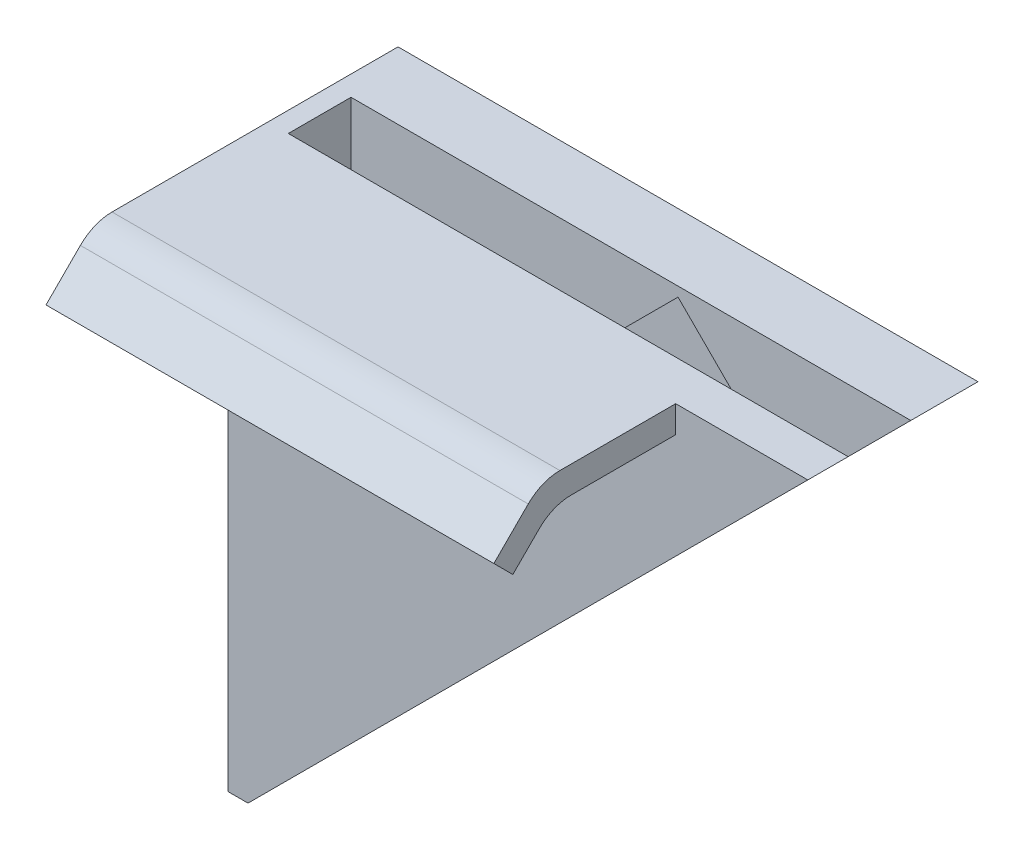
ISO-10303-21;
HEADER;
FILE_DESCRIPTION(('STEP AP214'),'2;1');
FILE_NAME('part.step','',(''),(''),'','','');
FILE_SCHEMA(('AUTOMOTIVE_DESIGN { 1 0 10303 214 1 1 1 1 }'));
ENDSEC;
DATA;
#1=APPLICATION_CONTEXT('core data for automotive mechanical design processes');
#2=APPLICATION_PROTOCOL_DEFINITION('international standard','automotive_design',2000,#1);
#3=PRODUCT_CONTEXT('',#1,'mechanical');
#4=PRODUCT('Part','Part','',(#3));
#5=PRODUCT_RELATED_PRODUCT_CATEGORY('part','',(#4));
#6=PRODUCT_DEFINITION_FORMATION('','',#4);
#7=PRODUCT_DEFINITION_CONTEXT('part definition',#1,'design');
#8=PRODUCT_DEFINITION('design','',#6,#7);
#9=PRODUCT_DEFINITION_SHAPE('','',#8);
#10=(LENGTH_UNIT() NAMED_UNIT(*) SI_UNIT(.MILLI.,.METRE.));
#11=(NAMED_UNIT(*) PLANE_ANGLE_UNIT() SI_UNIT($,.RADIAN.));
#12=(NAMED_UNIT(*) SI_UNIT($,.STERADIAN.) SOLID_ANGLE_UNIT());
#13=UNCERTAINTY_MEASURE_WITH_UNIT(LENGTH_MEASURE(1.E-05),#10,'distance_accuracy_value','');
#14=(GEOMETRIC_REPRESENTATION_CONTEXT(3) GLOBAL_UNCERTAINTY_ASSIGNED_CONTEXT((#13)) GLOBAL_UNIT_ASSIGNED_CONTEXT((#10,
#11,#12)) REPRESENTATION_CONTEXT('',''));
#15=CARTESIAN_POINT('',(0.,0.,0.));
#16=DIRECTION('',(0.,0.,1.));
#17=DIRECTION('',(1.,0.,0.));
#18=AXIS2_PLACEMENT_3D('',#15,#16,#17);
#19=CARTESIAN_POINT('',(0.,0.,1.8));
#20=DIRECTION('',(0.,0.,1.));
#21=DIRECTION('',(1.,0.,0.));
#22=AXIS2_PLACEMENT_3D('',#19,#20,#21);
#23=PLANE('',#22);
#24=DIRECTION('',(-1.,0.,0.));
#25=VECTOR('',#24,1.);
#26=CARTESIAN_POINT('',(0.,0.,1.8));
#27=LINE('',#26,#25);
#28=CARTESIAN_POINT('',(25.,0.,1.8));
#29=VERTEX_POINT('',#28);
#30=CARTESIAN_POINT('',(19.1,0.,1.8));
#31=VERTEX_POINT('',#30);
#32=EDGE_CURVE('E184',#29,#31,#27,.T.);
#33=ORIENTED_EDGE('',*,*,#32,.T.);
#34=DIRECTION('',(0.,-1.,0.));
#35=VECTOR('',#34,1.);
#36=CARTESIAN_POINT('',(19.1,-1.2,1.8));
#37=LINE('',#36,#35);
#38=CARTESIAN_POINT('',(19.1,-1.2,1.8));
#39=VERTEX_POINT('',#38);
#40=EDGE_CURVE('E177',#31,#39,#37,.T.);
#41=ORIENTED_EDGE('',*,*,#40,.T.);
#42=DIRECTION('',(-1.,0.,0.));
#43=VECTOR('',#42,1.);
#44=CARTESIAN_POINT('',(19.1,-1.2,1.8));
#45=LINE('',#44,#43);
#46=CARTESIAN_POINT('',(-0.9,-1.2,1.8));
#47=VERTEX_POINT('',#46);
#48=EDGE_CURVE('E159',#39,#47,#45,.T.);
#49=ORIENTED_EDGE('',*,*,#48,.T.);
#50=DIRECTION('',(0.,1.,0.));
#51=VECTOR('',#50,1.);
#52=CARTESIAN_POINT('',(-0.9,0.,1.8));
#53=LINE('',#52,#51);
#54=CARTESIAN_POINT('',(-0.899999999999997,-25.,1.8));
#55=VERTEX_POINT('',#54);
#56=EDGE_CURVE('E254',#55,#47,#53,.T.);
#57=ORIENTED_EDGE('',*,*,#56,.F.);
#58=DIRECTION('',(1.,0.,0.));
#59=VECTOR('',#58,1.);
#60=CARTESIAN_POINT('',(-0.899999999999997,-25.,1.8));
#61=LINE('',#60,#59);
#62=CARTESIAN_POINT('',(0.,-25.,1.8));
#63=VERTEX_POINT('',#62);
#64=EDGE_CURVE('E263',#55,#63,#61,.T.);
#65=ORIENTED_EDGE('',*,*,#64,.T.);
#66=DIRECTION('',(0.707106781186547,0.707106781186548,0.));
#67=VECTOR('',#66,1.);
#68=CARTESIAN_POINT('',(0.,-25.,1.8));
#69=LINE('',#68,#67);
#70=EDGE_CURVE('E277',#63,#29,#69,.T.);
#71=ORIENTED_EDGE('',*,*,#70,.T.);
#72=EDGE_LOOP('',(#33,#41,#49,#57,#65,#71));
#73=FACE_BOUND('',#72,.T.);
#74=ADVANCED_FACE('F35',(#73),#23,.T.);
#75=CARTESIAN_POINT('',(0.,0.,0.));
#76=DIRECTION('',(1.,0.,0.));
#77=DIRECTION('',(0.,1.,0.));
#78=AXIS2_PLACEMENT_3D('',#75,#76,#77);
#79=PLANE('',#78);
#80=DIRECTION('',(0.,0.,1.));
#81=VECTOR('',#80,1.);
#82=CARTESIAN_POINT('',(0.,-25.,1.8));
#83=LINE('',#82,#81);
#84=CARTESIAN_POINT('',(0.,-25.,-2.8));
#85=VERTEX_POINT('',#84);
#86=CARTESIAN_POINT('',(0.,-25.,0.));
#87=VERTEX_POINT('',#86);
#88=EDGE_CURVE('E266',#85,#87,#83,.T.);
#89=ORIENTED_EDGE('',*,*,#88,.F.);
#90=DIRECTION('',(0.,1.,0.));
#91=VECTOR('',#90,1.);
#92=CARTESIAN_POINT('',(0.,-25.,-2.8));
#93=LINE('',#92,#91);
#94=CARTESIAN_POINT('',(0.,0.,-2.8));
#95=VERTEX_POINT('',#94);
#96=EDGE_CURVE('E240',#85,#95,#93,.T.);
#97=ORIENTED_EDGE('',*,*,#96,.T.);
#98=DIRECTION('',(0.,0.,-1.));
#99=VECTOR('',#98,1.);
#100=CARTESIAN_POINT('',(0.,0.,1.8));
#101=LINE('',#100,#99);
#102=CARTESIAN_POINT('',(0.,0.,0.));
#103=VERTEX_POINT('',#102);
#104=EDGE_CURVE('E253',#103,#95,#101,.T.);
#105=ORIENTED_EDGE('',*,*,#104,.F.);
#106=DIRECTION('',(0.,-1.,0.));
#107=VECTOR('',#106,1.);
#108=CARTESIAN_POINT('',(0.,0.,0.));
#109=LINE('',#108,#107);
#110=EDGE_CURVE('E276',#103,#87,#109,.T.);
#111=ORIENTED_EDGE('',*,*,#110,.T.);
#112=EDGE_LOOP('',(#89,#97,#105,#111));
#113=FACE_BOUND('',#112,.T.);
#114=ADVANCED_FACE('F320',(#113),#79,.T.);
#115=CARTESIAN_POINT('',(0.,-25.,1.8));
#116=DIRECTION('',(-0.707106781186547,0.707106781186547,0.));
#117=DIRECTION('',(-0.707106781186547,-0.707106781186548,0.));
#118=AXIS2_PLACEMENT_3D('',#115,#116,#117);
#119=PLANE('',#118);
#120=DIRECTION('',(0.707106781186547,0.707106781186548,0.));
#121=VECTOR('',#120,1.);
#122=CARTESIAN_POINT('',(0.,-25.,0.));
#123=LINE('',#122,#121);
#124=CARTESIAN_POINT('',(25.,0.,0.));
#125=VERTEX_POINT('',#124);
#126=EDGE_CURVE('E284',#87,#125,#123,.T.);
#127=ORIENTED_EDGE('',*,*,#126,.T.);
#128=DIRECTION('',(0.,0.,-1.));
#129=VECTOR('',#128,1.);
#130=CARTESIAN_POINT('',(25.,0.,1.8));
#131=LINE('',#130,#129);
#132=EDGE_CURVE('E281',#29,#125,#131,.T.);
#133=ORIENTED_EDGE('',*,*,#132,.F.);
#134=ORIENTED_EDGE('',*,*,#70,.F.);
#135=DIRECTION('',(0.,0.,-1.));
#136=VECTOR('',#135,1.);
#137=CARTESIAN_POINT('',(0.,-25.,1.8));
#138=LINE('',#137,#136);
#139=EDGE_CURVE('E289',#63,#87,#138,.T.);
#140=ORIENTED_EDGE('',*,*,#139,.T.);
#141=EDGE_LOOP('',(#127,#133,#134,#140));
#142=FACE_BOUND('',#141,.T.);
#143=ADVANCED_FACE('F325',(#142),#119,.F.);
#144=CARTESIAN_POINT('',(0.,0.,1.8));
#145=DIRECTION('',(0.,-1.,0.));
#146=DIRECTION('',(0.,0.,-1.));
#147=AXIS2_PLACEMENT_3D('',#144,#145,#146);
#148=PLANE('',#147);
#149=DIRECTION('',(0.,0.,-1.));
#150=VECTOR('',#149,1.);
#151=CARTESIAN_POINT('',(-0.9,0.,1.8));
#152=LINE('',#151,#150);
#153=CARTESIAN_POINT('',(-0.9,0.,6.97157287525381));
#154=VERTEX_POINT('',#153);
#155=CARTESIAN_POINT('',(-0.9,0.,-5.8));
#156=VERTEX_POINT('',#155);
#157=EDGE_CURVE('E256',#154,#156,#152,.T.);
#158=ORIENTED_EDGE('',*,*,#157,.F.);
#159=DIRECTION('',(-1.,0.,0.));
#160=VECTOR('',#159,1.);
#161=CARTESIAN_POINT('',(19.1,0.,6.97157287525381));
#162=LINE('',#161,#160);
#163=CARTESIAN_POINT('',(19.1,0.,6.97157287525381));
#164=VERTEX_POINT('',#163);
#165=EDGE_CURVE('E50',#154,#164,#162,.F.);
#166=ORIENTED_EDGE('',*,*,#165,.T.);
#167=DIRECTION('',(0.,0.,-1.));
#168=VECTOR('',#167,1.);
#169=CARTESIAN_POINT('',(19.1,0.,1.8));
#170=LINE('',#169,#168);
#171=EDGE_CURVE('E172',#164,#31,#170,.T.);
#172=ORIENTED_EDGE('',*,*,#171,.T.);
#173=ORIENTED_EDGE('',*,*,#32,.F.);
#174=ORIENTED_EDGE('',*,*,#132,.T.);
#175=DIRECTION('',(-1.,0.,0.));
#176=VECTOR('',#175,1.);
#177=CARTESIAN_POINT('',(0.,0.,0.));
#178=LINE('',#177,#176);
#179=EDGE_CURVE('E279',#125,#103,#178,.T.);
#180=ORIENTED_EDGE('',*,*,#179,.T.);
#181=ORIENTED_EDGE('',*,*,#104,.T.);
#182=DIRECTION('',(1.,0.,0.));
#183=VECTOR('',#182,1.);
#184=CARTESIAN_POINT('',(0.,0.,-2.8));
#185=LINE('',#184,#183);
#186=CARTESIAN_POINT('',(25.,0.,-2.8));
#187=VERTEX_POINT('',#186);
#188=EDGE_CURVE('E243',#95,#187,#185,.T.);
#189=ORIENTED_EDGE('',*,*,#188,.T.);
#190=DIRECTION('',(0.,0.,-1.));
#191=VECTOR('',#190,1.);
#192=CARTESIAN_POINT('',(25.,0.,-2.8));
#193=LINE('',#192,#191);
#194=CARTESIAN_POINT('',(25.,0.,-5.8));
#195=VERTEX_POINT('',#194);
#196=EDGE_CURVE('E249',#187,#195,#193,.T.);
#197=ORIENTED_EDGE('',*,*,#196,.T.);
#198=DIRECTION('',(1.,0.,0.));
#199=VECTOR('',#198,1.);
#200=CARTESIAN_POINT('',(-0.9,0.,-5.8));
#201=LINE('',#200,#199);
#202=EDGE_CURVE('E274',#156,#195,#201,.T.);
#203=ORIENTED_EDGE('',*,*,#202,.F.);
#204=EDGE_LOOP('',(#158,#166,#172,#173,#174,#180,#181,#189,#197,#203));
#205=FACE_BOUND('',#204,.T.);
#206=ADVANCED_FACE('F335',(#205),#148,.F.);
#207=CARTESIAN_POINT('',(0.,0.,0.));
#208=DIRECTION('',(0.,0.,1.));
#209=DIRECTION('',(1.,0.,0.));
#210=AXIS2_PLACEMENT_3D('',#207,#208,#209);
#211=PLANE('',#210);
#212=ORIENTED_EDGE('',*,*,#110,.F.);
#213=ORIENTED_EDGE('',*,*,#179,.F.);
#214=ORIENTED_EDGE('',*,*,#126,.F.);
#215=EDGE_LOOP('',(#212,#213,#214));
#216=FACE_BOUND('',#215,.T.);
#217=ADVANCED_FACE('F332',(#216),#211,.F.);
#218=CARTESIAN_POINT('',(-0.9,0.,-5.8));
#219=DIRECTION('',(0.,0.,1.));
#220=DIRECTION('',(0.,-1.,0.));
#221=AXIS2_PLACEMENT_3D('',#218,#219,#220);
#222=PLANE('',#221);
#223=ORIENTED_EDGE('',*,*,#202,.T.);
#224=DIRECTION('',(-0.707106781186547,-0.707106781186548,0.));
#225=VECTOR('',#224,1.);
#226=CARTESIAN_POINT('',(25.,0.,-5.8));
#227=LINE('',#226,#225);
#228=CARTESIAN_POINT('',(0.,-25.,-5.8));
#229=VERTEX_POINT('',#228);
#230=EDGE_CURVE('E233',#195,#229,#227,.T.);
#231=ORIENTED_EDGE('',*,*,#230,.T.);
#232=DIRECTION('',(1.,0.,0.));
#233=VECTOR('',#232,1.);
#234=CARTESIAN_POINT('',(-0.899999999999997,-25.,-5.8));
#235=LINE('',#234,#233);
#236=CARTESIAN_POINT('',(-0.899999999999997,-25.,-5.8));
#237=VERTEX_POINT('',#236);
#238=EDGE_CURVE('E271',#237,#229,#235,.T.);
#239=ORIENTED_EDGE('',*,*,#238,.F.);
#240=DIRECTION('',(0.,-1.,0.));
#241=VECTOR('',#240,1.);
#242=CARTESIAN_POINT('',(-0.9,0.,-5.8));
#243=LINE('',#242,#241);
#244=EDGE_CURVE('E259',#156,#237,#243,.T.);
#245=ORIENTED_EDGE('',*,*,#244,.F.);
#246=EDGE_LOOP('',(#223,#231,#239,#245));
#247=FACE_BOUND('',#246,.T.);
#248=ADVANCED_FACE('F330',(#247),#222,.F.);
#249=CARTESIAN_POINT('',(-0.899999999999997,-25.,1.8));
#250=DIRECTION('',(0.,1.,0.));
#251=DIRECTION('',(-1.,0.,0.));
#252=AXIS2_PLACEMENT_3D('',#249,#250,#251);
#253=PLANE('',#252);
#254=EDGE_CURVE('E257',#229,#85,#83,.T.);
#255=ORIENTED_EDGE('',*,*,#254,.T.);
#256=ORIENTED_EDGE('',*,*,#88,.T.);
#257=ORIENTED_EDGE('',*,*,#139,.F.);
#258=ORIENTED_EDGE('',*,*,#64,.F.);
#259=DIRECTION('',(0.,0.,1.));
#260=VECTOR('',#259,1.);
#261=CARTESIAN_POINT('',(-0.899999999999997,-25.,1.8));
#262=LINE('',#261,#260);
#263=EDGE_CURVE('E261',#237,#55,#262,.T.);
#264=ORIENTED_EDGE('',*,*,#263,.F.);
#265=ORIENTED_EDGE('',*,*,#238,.T.);
#266=EDGE_LOOP('',(#255,#256,#257,#258,#264,#265));
#267=FACE_BOUND('',#266,.T.);
#268=ADVANCED_FACE('F358',(#267),#253,.F.);
#269=CARTESIAN_POINT('',(-0.9,0.,0.));
#270=DIRECTION('',(1.,0.,0.));
#271=DIRECTION('',(0.,1.,0.));
#272=AXIS2_PLACEMENT_3D('',#269,#270,#271);
#273=PLANE('',#272);
#274=DIRECTION('',(0.,0.707106781186548,-0.707106781186547));
#275=VECTOR('',#274,1.);
#276=CARTESIAN_POINT('',(-0.9,0.,7.8));
#277=LINE('',#276,#275);
#278=CARTESIAN_POINT('',(-0.9,-2.12132034355964,9.92132034355964));
#279=VERTEX_POINT('',#278);
#280=CARTESIAN_POINT('',(-0.9,-0.585786437626905,8.3857864376269));
#281=VERTEX_POINT('',#280);
#282=EDGE_CURVE('E185',#279,#281,#277,.T.);
#283=ORIENTED_EDGE('',*,*,#282,.T.);
#284=CARTESIAN_POINT('',(-0.900000000000001,-2.,6.97157287525381));
#285=DIRECTION('',(1.,0.,0.));
#286=DIRECTION('',(0.,1.,0.));
#287=AXIS2_PLACEMENT_3D('',#284,#285,#286);
#288=CIRCLE('',#287,2.);
#289=EDGE_CURVE('E58',#281,#154,#288,.F.);
#290=ORIENTED_EDGE('',*,*,#289,.T.);
#291=ORIENTED_EDGE('',*,*,#157,.T.);
#292=ORIENTED_EDGE('',*,*,#244,.T.);
#293=ORIENTED_EDGE('',*,*,#263,.T.);
#294=ORIENTED_EDGE('',*,*,#56,.T.);
#295=DIRECTION('',(0.,0.,1.));
#296=VECTOR('',#295,1.);
#297=CARTESIAN_POINT('',(-0.9,-1.2,7.30294372515229));
#298=LINE('',#297,#296);
#299=CARTESIAN_POINT('',(-0.9,-1.2,6.4745166004061));
#300=VERTEX_POINT('',#299);
#301=EDGE_CURVE('E166',#47,#300,#298,.T.);
#302=ORIENTED_EDGE('',*,*,#301,.T.);
#303=CARTESIAN_POINT('',(-0.900000000000001,-3.2,6.4745166004061));
#304=DIRECTION('',(1.,0.,0.));
#305=DIRECTION('',(0.,1.,0.));
#306=AXIS2_PLACEMENT_3D('',#303,#304,#305);
#307=CIRCLE('',#306,2.);
#308=CARTESIAN_POINT('',(-0.9,-1.7857864376269,7.88873016277919));
#309=VERTEX_POINT('',#308);
#310=EDGE_CURVE('E43',#300,#309,#307,.T.);
#311=ORIENTED_EDGE('',*,*,#310,.T.);
#312=DIRECTION('',(0.,-0.707106781186547,0.707106781186548));
#313=VECTOR('',#312,1.);
#314=CARTESIAN_POINT('',(-0.9,-2.9698484809835,9.07279220613579));
#315=LINE('',#314,#313);
#316=CARTESIAN_POINT('',(-0.9,-2.9698484809835,9.07279220613579));
#317=VERTEX_POINT('',#316);
#318=EDGE_CURVE('E199',#309,#317,#315,.T.);
#319=ORIENTED_EDGE('',*,*,#318,.T.);
#320=DIRECTION('',(0.,0.707106781186549,0.707106781186546));
#321=VECTOR('',#320,1.);
#322=CARTESIAN_POINT('',(-0.9,-2.12132034355964,9.92132034355964));
#323=LINE('',#322,#321);
#324=EDGE_CURVE('E187',#317,#279,#323,.T.);
#325=ORIENTED_EDGE('',*,*,#324,.T.);
#326=EDGE_LOOP('',(#283,#290,#291,#292,#293,#294,#302,#311,#319,#325));
#327=FACE_BOUND('',#326,.T.);
#328=ADVANCED_FACE('F303',(#327),#273,.F.);
#329=CARTESIAN_POINT('',(25.,0.,-2.8));
#330=DIRECTION('',(0.707106781186548,-0.707106781186547,0.));
#331=DIRECTION('',(0.707106781186547,0.707106781186548,0.));
#332=AXIS2_PLACEMENT_3D('',#329,#330,#331);
#333=PLANE('',#332);
#334=ORIENTED_EDGE('',*,*,#230,.F.);
#335=ORIENTED_EDGE('',*,*,#196,.F.);
#336=DIRECTION('',(-0.707106781186547,-0.707106781186548,0.));
#337=VECTOR('',#336,1.);
#338=CARTESIAN_POINT('',(25.,0.,-2.8));
#339=LINE('',#338,#337);
#340=EDGE_CURVE('E246',#187,#85,#339,.T.);
#341=ORIENTED_EDGE('',*,*,#340,.T.);
#342=ORIENTED_EDGE('',*,*,#254,.F.);
#343=EDGE_LOOP('',(#334,#335,#341,#342));
#344=FACE_BOUND('',#343,.T.);
#345=ADVANCED_FACE('F356',(#344),#333,.T.);
#346=CARTESIAN_POINT('',(0.,0.,-2.8));
#347=DIRECTION('',(0.,0.,-1.));
#348=DIRECTION('',(0.,1.,0.));
#349=AXIS2_PLACEMENT_3D('',#346,#347,#348);
#350=PLANE('',#349);
#351=DIRECTION('',(-0.707106781186547,-0.707106781186548,0.));
#352=VECTOR('',#351,1.);
#353=CARTESIAN_POINT('',(0.426151711239702,-14.60364267403,-2.8));
#354=LINE('',#353,#352);
#355=CARTESIAN_POINT('',(14.60364267403,-0.426151711239697,-2.8));
#356=VERTEX_POINT('',#355);
#357=CARTESIAN_POINT('',(0.426151711239702,-14.60364267403,-2.8));
#358=VERTEX_POINT('',#357);
#359=EDGE_CURVE('E223',#356,#358,#354,.T.);
#360=ORIENTED_EDGE('',*,*,#359,.F.);
#361=DIRECTION('',(-0.707106781186548,0.707106781186547,0.));
#362=VECTOR('',#361,1.);
#363=CARTESIAN_POINT('',(14.60364267403,-0.426151711239697,-2.8));
#364=LINE('',#363,#362);
#365=CARTESIAN_POINT('',(18.8816387002086,-4.70414773741831,-2.8));
#366=VERTEX_POINT('',#365);
#367=EDGE_CURVE('E205',#366,#356,#364,.T.);
#368=ORIENTED_EDGE('',*,*,#367,.F.);
#369=DIRECTION('',(0.707106781186547,0.707106781186548,0.));
#370=VECTOR('',#369,1.);
#371=CARTESIAN_POINT('',(18.8816387002086,-4.70414773741831,-2.8));
#372=LINE('',#371,#370);
#373=CARTESIAN_POINT('',(4.70414773741832,-18.8816387002086,-2.8));
#374=VERTEX_POINT('',#373);
#375=EDGE_CURVE('E212',#374,#366,#372,.T.);
#376=ORIENTED_EDGE('',*,*,#375,.F.);
#377=DIRECTION('',(0.707106781186548,-0.707106781186547,0.));
#378=VECTOR('',#377,1.);
#379=CARTESIAN_POINT('',(4.70414773741832,-18.8816387002086,-2.8));
#380=LINE('',#379,#378);
#381=EDGE_CURVE('E226',#358,#374,#380,.T.);
#382=ORIENTED_EDGE('',*,*,#381,.F.);
#383=EDGE_LOOP('',(#360,#368,#376,#382));
#384=FACE_BOUND('',#383,.T.);
#385=ORIENTED_EDGE('',*,*,#96,.F.);
#386=ORIENTED_EDGE('',*,*,#340,.F.);
#387=ORIENTED_EDGE('',*,*,#188,.F.);
#388=EDGE_LOOP('',(#385,#386,#387));
#389=FACE_BOUND('',#388,.T.);
#390=ADVANCED_FACE('F353',(#384,#389),#350,.F.);
#391=CARTESIAN_POINT('',(14.60364267403,-0.426151711239697,-4.85));
#392=DIRECTION('',(0.707106781186547,0.707106781186548,0.));
#393=DIRECTION('',(-0.707106781186548,0.707106781186547,0.));
#394=AXIS2_PLACEMENT_3D('',#391,#392,#393);
#395=PLANE('',#394);
#396=ORIENTED_EDGE('',*,*,#367,.T.);
#397=DIRECTION('',(0.,0.,1.));
#398=VECTOR('',#397,1.);
#399=CARTESIAN_POINT('',(14.60364267403,-0.426151711239697,-4.85));
#400=LINE('',#399,#398);
#401=CARTESIAN_POINT('',(14.60364267403,-0.426151711239697,-4.85));
#402=VERTEX_POINT('',#401);
#403=EDGE_CURVE('E221',#402,#356,#400,.T.);
#404=ORIENTED_EDGE('',*,*,#403,.F.);
#405=DIRECTION('',(-0.707106781186548,0.707106781186547,0.));
#406=VECTOR('',#405,1.);
#407=CARTESIAN_POINT('',(14.60364267403,-0.426151711239697,-4.85));
#408=LINE('',#407,#406);
#409=CARTESIAN_POINT('',(18.8816387002086,-4.70414773741831,-4.85));
#410=VERTEX_POINT('',#409);
#411=EDGE_CURVE('E208',#410,#402,#408,.T.);
#412=ORIENTED_EDGE('',*,*,#411,.F.);
#413=DIRECTION('',(0.,0.,1.));
#414=VECTOR('',#413,1.);
#415=CARTESIAN_POINT('',(18.8816387002086,-4.70414773741831,-4.85));
#416=LINE('',#415,#414);
#417=EDGE_CURVE('E231',#410,#366,#416,.T.);
#418=ORIENTED_EDGE('',*,*,#417,.T.);
#419=EDGE_LOOP('',(#396,#404,#412,#418));
#420=FACE_BOUND('',#419,.T.);
#421=ADVANCED_FACE('F393',(#420),#395,.F.);
#422=CARTESIAN_POINT('',(18.8816387002086,-4.70414773741831,-4.85));
#423=DIRECTION('',(0.707106781186548,-0.707106781186547,0.));
#424=DIRECTION('',(0.707106781186547,0.707106781186548,0.));
#425=AXIS2_PLACEMENT_3D('',#422,#423,#424);
#426=PLANE('',#425);
#427=ORIENTED_EDGE('',*,*,#375,.T.);
#428=ORIENTED_EDGE('',*,*,#417,.F.);
#429=DIRECTION('',(0.707106781186547,0.707106781186548,0.));
#430=VECTOR('',#429,1.);
#431=CARTESIAN_POINT('',(18.8816387002086,-4.70414773741831,-4.85));
#432=LINE('',#431,#430);
#433=CARTESIAN_POINT('',(4.70414773741832,-18.8816387002086,-4.85));
#434=VERTEX_POINT('',#433);
#435=EDGE_CURVE('E218',#434,#410,#432,.T.);
#436=ORIENTED_EDGE('',*,*,#435,.F.);
#437=DIRECTION('',(0.,0.,1.));
#438=VECTOR('',#437,1.);
#439=CARTESIAN_POINT('',(4.70414773741832,-18.8816387002086,-4.85));
#440=LINE('',#439,#438);
#441=EDGE_CURVE('E234',#434,#374,#440,.T.);
#442=ORIENTED_EDGE('',*,*,#441,.T.);
#443=EDGE_LOOP('',(#427,#428,#436,#442));
#444=FACE_BOUND('',#443,.T.);
#445=ADVANCED_FACE('F389',(#444),#426,.F.);
#446=CARTESIAN_POINT('',(4.70414773741832,-18.8816387002086,-4.85));
#447=DIRECTION('',(-0.707106781186547,-0.707106781186548,0.));
#448=DIRECTION('',(0.707106781186548,-0.707106781186547,0.));
#449=AXIS2_PLACEMENT_3D('',#446,#447,#448);
#450=PLANE('',#449);
#451=ORIENTED_EDGE('',*,*,#381,.T.);
#452=ORIENTED_EDGE('',*,*,#441,.F.);
#453=DIRECTION('',(0.707106781186548,-0.707106781186547,0.));
#454=VECTOR('',#453,1.);
#455=CARTESIAN_POINT('',(4.70414773741832,-18.8816387002086,-4.85));
#456=LINE('',#455,#454);
#457=CARTESIAN_POINT('',(0.426151711239702,-14.60364267403,-4.85));
#458=VERTEX_POINT('',#457);
#459=EDGE_CURVE('E215',#458,#434,#456,.T.);
#460=ORIENTED_EDGE('',*,*,#459,.F.);
#461=DIRECTION('',(0.,0.,1.));
#462=VECTOR('',#461,1.);
#463=CARTESIAN_POINT('',(0.426151711239702,-14.60364267403,-4.85));
#464=LINE('',#463,#462);
#465=EDGE_CURVE('E236',#458,#358,#464,.T.);
#466=ORIENTED_EDGE('',*,*,#465,.T.);
#467=EDGE_LOOP('',(#451,#452,#460,#466));
#468=FACE_BOUND('',#467,.T.);
#469=ADVANCED_FACE('F392',(#468),#450,.F.);
#470=CARTESIAN_POINT('',(0.426151711239702,-14.60364267403,-4.85));
#471=DIRECTION('',(-0.707106781186548,0.707106781186547,0.));
#472=DIRECTION('',(-0.707106781186547,-0.707106781186548,0.));
#473=AXIS2_PLACEMENT_3D('',#470,#471,#472);
#474=PLANE('',#473);
#475=ORIENTED_EDGE('',*,*,#359,.T.);
#476=ORIENTED_EDGE('',*,*,#465,.F.);
#477=DIRECTION('',(-0.707106781186547,-0.707106781186548,0.));
#478=VECTOR('',#477,1.);
#479=CARTESIAN_POINT('',(0.426151711239702,-14.60364267403,-4.85));
#480=LINE('',#479,#478);
#481=EDGE_CURVE('E211',#402,#458,#480,.T.);
#482=ORIENTED_EDGE('',*,*,#481,.F.);
#483=ORIENTED_EDGE('',*,*,#403,.T.);
#484=EDGE_LOOP('',(#475,#476,#482,#483));
#485=FACE_BOUND('',#484,.T.);
#486=ADVANCED_FACE('F387',(#485),#474,.F.);
#487=CARTESIAN_POINT('',(0.,0.,-4.85));
#488=DIRECTION('',(0.,0.,-1.));
#489=DIRECTION('',(-1.,0.,0.));
#490=AXIS2_PLACEMENT_3D('',#487,#488,#489);
#491=PLANE('',#490);
#492=ORIENTED_EDGE('',*,*,#411,.T.);
#493=ORIENTED_EDGE('',*,*,#481,.T.);
#494=ORIENTED_EDGE('',*,*,#459,.T.);
#495=ORIENTED_EDGE('',*,*,#435,.T.);
#496=EDGE_LOOP('',(#492,#493,#494,#495));
#497=FACE_BOUND('',#496,.T.);
#498=ADVANCED_FACE('F380',(#497),#491,.F.);
#499=CARTESIAN_POINT('',(19.1,0.,7.8));
#500=DIRECTION('',(0.,0.707106781186547,0.707106781186548));
#501=DIRECTION('',(0.,-0.707106781186548,0.707106781186547));
#502=AXIS2_PLACEMENT_3D('',#499,#500,#501);
#503=PLANE('',#502);
#504=DIRECTION('',(0.,0.707106781186548,-0.707106781186547));
#505=VECTOR('',#504,1.);
#506=CARTESIAN_POINT('',(19.1,0.,7.8));
#507=LINE('',#506,#505);
#508=CARTESIAN_POINT('',(19.1,-2.12132034355964,9.92132034355964));
#509=VERTEX_POINT('',#508);
#510=CARTESIAN_POINT('',(19.1,-0.585786437626905,8.38578643762691));
#511=VERTEX_POINT('',#510);
#512=EDGE_CURVE('E194',#509,#511,#507,.T.);
#513=ORIENTED_EDGE('',*,*,#512,.T.);
#514=DIRECTION('',(-1.,0.,0.));
#515=VECTOR('',#514,1.);
#516=CARTESIAN_POINT('',(-0.900000000000002,-0.585786437626905,8.3857864376269));
#517=LINE('',#516,#515);
#518=EDGE_CURVE('E296',#511,#281,#517,.T.);
#519=ORIENTED_EDGE('',*,*,#518,.T.);
#520=ORIENTED_EDGE('',*,*,#282,.F.);
#521=DIRECTION('',(-1.,0.,0.));
#522=VECTOR('',#521,1.);
#523=CARTESIAN_POINT('',(19.1,-2.12132034355964,9.92132034355964));
#524=LINE('',#523,#522);
#525=EDGE_CURVE('E203',#509,#279,#524,.T.);
#526=ORIENTED_EDGE('',*,*,#525,.F.);
#527=EDGE_LOOP('',(#513,#519,#520,#526));
#528=FACE_BOUND('',#527,.T.);
#529=ADVANCED_FACE('F369',(#528),#503,.T.);
#530=CARTESIAN_POINT('',(19.1,-2.12132034355964,9.92132034355964));
#531=DIRECTION('',(0.,-0.707106781186546,0.707106781186549));
#532=DIRECTION('',(0.,-0.707106781186549,-0.707106781186546));
#533=AXIS2_PLACEMENT_3D('',#530,#531,#532);
#534=PLANE('',#533);
#535=ORIENTED_EDGE('',*,*,#324,.F.);
#536=DIRECTION('',(-1.,0.,0.));
#537=VECTOR('',#536,1.);
#538=CARTESIAN_POINT('',(19.1,-2.9698484809835,9.07279220613579));
#539=LINE('',#538,#537);
#540=CARTESIAN_POINT('',(19.1,-2.9698484809835,9.07279220613579));
#541=VERTEX_POINT('',#540);
#542=EDGE_CURVE('E171',#541,#317,#539,.T.);
#543=ORIENTED_EDGE('',*,*,#542,.F.);
#544=DIRECTION('',(0.,0.707106781186549,0.707106781186546));
#545=VECTOR('',#544,1.);
#546=CARTESIAN_POINT('',(19.1,-2.12132034355964,9.92132034355964));
#547=LINE('',#546,#545);
#548=EDGE_CURVE('E191',#541,#509,#547,.T.);
#549=ORIENTED_EDGE('',*,*,#548,.T.);
#550=ORIENTED_EDGE('',*,*,#525,.T.);
#551=EDGE_LOOP('',(#535,#543,#549,#550));
#552=FACE_BOUND('',#551,.T.);
#553=ADVANCED_FACE('F372',(#552),#534,.T.);
#554=CARTESIAN_POINT('',(19.1,-2.9698484809835,9.07279220613579));
#555=DIRECTION('',(0.,-0.707106781186548,-0.707106781186547));
#556=DIRECTION('',(0.,0.707106781186547,-0.707106781186548));
#557=AXIS2_PLACEMENT_3D('',#554,#555,#556);
#558=PLANE('',#557);
#559=ORIENTED_EDGE('',*,*,#318,.F.);
#560=DIRECTION('',(-1.,0.,0.));
#561=VECTOR('',#560,1.);
#562=CARTESIAN_POINT('',(19.1,-1.7857864376269,7.88873016277919));
#563=LINE('',#562,#561);
#564=CARTESIAN_POINT('',(19.1,-1.7857864376269,7.88873016277919));
#565=VERTEX_POINT('',#564);
#566=EDGE_CURVE('E294',#309,#565,#563,.F.);
#567=ORIENTED_EDGE('',*,*,#566,.T.);
#568=DIRECTION('',(0.,-0.707106781186547,0.707106781186548));
#569=VECTOR('',#568,1.);
#570=CARTESIAN_POINT('',(19.1,-2.9698484809835,9.07279220613579));
#571=LINE('',#570,#569);
#572=EDGE_CURVE('E181',#565,#541,#571,.T.);
#573=ORIENTED_EDGE('',*,*,#572,.T.);
#574=ORIENTED_EDGE('',*,*,#542,.T.);
#575=EDGE_LOOP('',(#559,#567,#573,#574));
#576=FACE_BOUND('',#575,.T.);
#577=ADVANCED_FACE('F307',(#576),#558,.T.);
#578=CARTESIAN_POINT('',(19.1,-1.2,7.30294372515229));
#579=DIRECTION('',(0.,-1.,0.));
#580=DIRECTION('',(1.,0.,0.));
#581=AXIS2_PLACEMENT_3D('',#578,#579,#580);
#582=PLANE('',#581);
#583=DIRECTION('',(0.,0.,1.));
#584=VECTOR('',#583,1.);
#585=CARTESIAN_POINT('',(19.1,-1.2,7.30294372515229));
#586=LINE('',#585,#584);
#587=CARTESIAN_POINT('',(19.1,-1.2,6.4745166004061));
#588=VERTEX_POINT('',#587);
#589=EDGE_CURVE('E163',#39,#588,#586,.T.);
#590=ORIENTED_EDGE('',*,*,#589,.T.);
#591=DIRECTION('',(-1.,0.,0.));
#592=VECTOR('',#591,1.);
#593=CARTESIAN_POINT('',(-0.900000000000002,-1.2,6.4745166004061));
#594=LINE('',#593,#592);
#595=EDGE_CURVE('E292',#588,#300,#594,.T.);
#596=ORIENTED_EDGE('',*,*,#595,.T.);
#597=ORIENTED_EDGE('',*,*,#301,.F.);
#598=ORIENTED_EDGE('',*,*,#48,.F.);
#599=EDGE_LOOP('',(#590,#596,#597,#598));
#600=FACE_BOUND('',#599,.T.);
#601=ADVANCED_FACE('F161',(#600),#582,.T.);
#602=CARTESIAN_POINT('',(19.1,0.,0.));
#603=DIRECTION('',(1.,0.,0.));
#604=DIRECTION('',(0.,1.,0.));
#605=AXIS2_PLACEMENT_3D('',#602,#603,#604);
#606=PLANE('',#605);
#607=ORIENTED_EDGE('',*,*,#171,.F.);
#608=CARTESIAN_POINT('',(19.1,-2.,6.97157287525381));
#609=DIRECTION('',(1.,0.,0.));
#610=DIRECTION('',(0.,1.,0.));
#611=AXIS2_PLACEMENT_3D('',#608,#609,#610);
#612=CIRCLE('',#611,2.);
#613=EDGE_CURVE('E301',#164,#511,#612,.T.);
#614=ORIENTED_EDGE('',*,*,#613,.T.);
#615=ORIENTED_EDGE('',*,*,#512,.F.);
#616=ORIENTED_EDGE('',*,*,#548,.F.);
#617=ORIENTED_EDGE('',*,*,#572,.F.);
#618=CARTESIAN_POINT('',(19.1,-3.2,6.4745166004061));
#619=DIRECTION('',(1.,0.,0.));
#620=DIRECTION('',(0.,1.,0.));
#621=AXIS2_PLACEMENT_3D('',#618,#619,#620);
#622=CIRCLE('',#621,2.);
#623=EDGE_CURVE('E11',#565,#588,#622,.F.);
#624=ORIENTED_EDGE('',*,*,#623,.T.);
#625=ORIENTED_EDGE('',*,*,#589,.F.);
#626=ORIENTED_EDGE('',*,*,#40,.F.);
#627=EDGE_LOOP('',(#607,#614,#615,#616,#617,#624,#625,#626));
#628=FACE_BOUND('',#627,.T.);
#629=ADVANCED_FACE('F176',(#628),#606,.T.);
#630=CARTESIAN_POINT('',(19.1,-3.2,6.4745166004061));
#631=DIRECTION('',(1.,0.,0.));
#632=DIRECTION('',(0.,1.,0.));
#633=AXIS2_PLACEMENT_3D('',#630,#631,#632);
#634=CYLINDRICAL_SURFACE('',#633,2.);
#635=ORIENTED_EDGE('',*,*,#623,.F.);
#636=ORIENTED_EDGE('',*,*,#566,.F.);
#637=ORIENTED_EDGE('',*,*,#310,.F.);
#638=ORIENTED_EDGE('',*,*,#595,.F.);
#639=EDGE_LOOP('',(#635,#636,#637,#638));
#640=FACE_BOUND('',#639,.T.);
#641=ADVANCED_FACE('F310',(#640),#634,.F.);
#642=CARTESIAN_POINT('',(19.1,-2.,6.97157287525381));
#643=DIRECTION('',(1.,0.,0.));
#644=DIRECTION('',(0.,0.,-1.));
#645=AXIS2_PLACEMENT_3D('',#642,#643,#644);
#646=CYLINDRICAL_SURFACE('',#645,2.);
#647=ORIENTED_EDGE('',*,*,#613,.F.);
#648=ORIENTED_EDGE('',*,*,#165,.F.);
#649=ORIENTED_EDGE('',*,*,#289,.F.);
#650=ORIENTED_EDGE('',*,*,#518,.F.);
#651=EDGE_LOOP('',(#647,#648,#649,#650));
#652=FACE_BOUND('',#651,.T.);
#653=ADVANCED_FACE('F37',(#652),#646,.T.);
#654=CLOSED_SHELL('',(#74,#114,#143,#206,#217,#248,#268,#328,#345,#390,#421,#445,#469,#486,#498,
#529,#553,#577,#601,#629,#641,#653));
#655=MANIFOLD_SOLID_BREP('B2',#654);
#656=ADVANCED_BREP_SHAPE_REPRESENTATION('',(#18,#655),#14);
#657=SHAPE_DEFINITION_REPRESENTATION(#9,#656);
ENDSEC;
END-ISO-10303-21;
